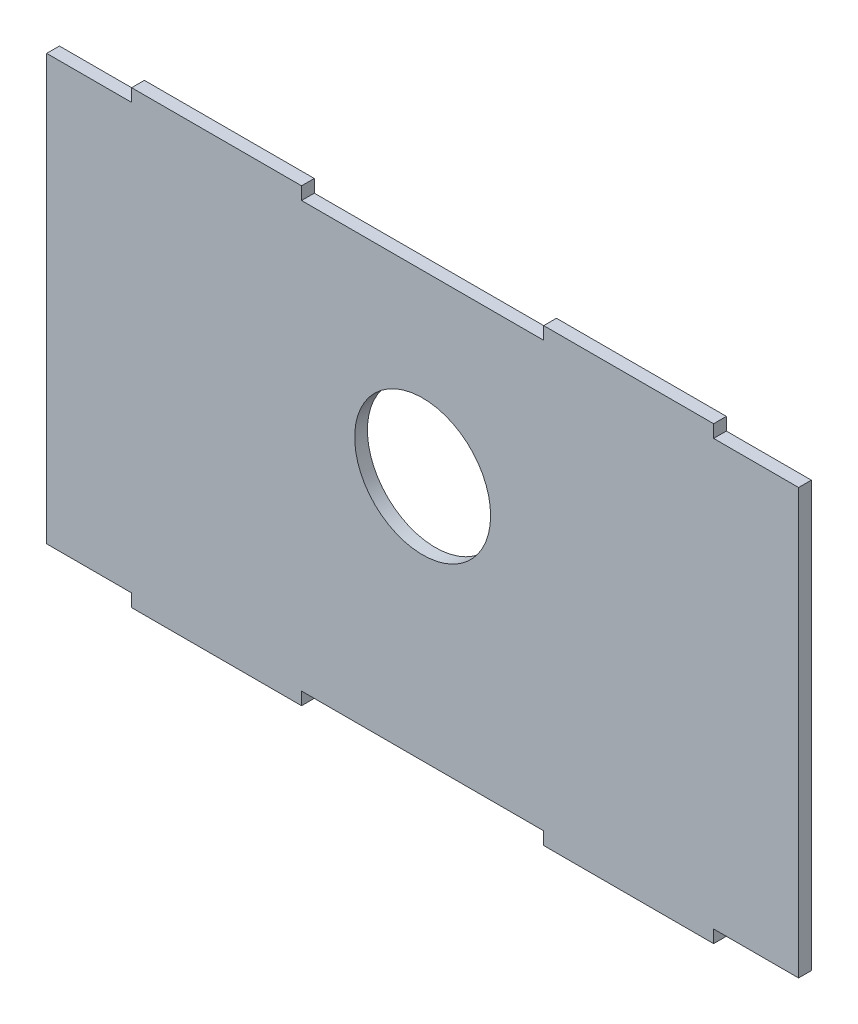
ISO-10303-21;
HEADER;
FILE_DESCRIPTION(('STEP AP214'),'2;1');
FILE_NAME('part.step','',(''),(''),'','','');
FILE_SCHEMA(('AUTOMOTIVE_DESIGN { 1 0 10303 214 1 1 1 1 }'));
ENDSEC;
DATA;
#1=APPLICATION_CONTEXT('core data for automotive mechanical design processes');
#2=APPLICATION_PROTOCOL_DEFINITION('international standard','automotive_design',2000,#1);
#3=PRODUCT_CONTEXT('',#1,'mechanical');
#4=PRODUCT('Part','Part','',(#3));
#5=PRODUCT_RELATED_PRODUCT_CATEGORY('part','',(#4));
#6=PRODUCT_DEFINITION_FORMATION('','',#4);
#7=PRODUCT_DEFINITION_CONTEXT('part definition',#1,'design');
#8=PRODUCT_DEFINITION('design','',#6,#7);
#9=PRODUCT_DEFINITION_SHAPE('','',#8);
#10=(LENGTH_UNIT() NAMED_UNIT(*) SI_UNIT(.MILLI.,.METRE.));
#11=(NAMED_UNIT(*) PLANE_ANGLE_UNIT() SI_UNIT($,.RADIAN.));
#12=(NAMED_UNIT(*) SI_UNIT($,.STERADIAN.) SOLID_ANGLE_UNIT());
#13=UNCERTAINTY_MEASURE_WITH_UNIT(LENGTH_MEASURE(1.E-05),#10,'distance_accuracy_value','');
#14=(GEOMETRIC_REPRESENTATION_CONTEXT(3) GLOBAL_UNCERTAINTY_ASSIGNED_CONTEXT((#13)) GLOBAL_UNIT_ASSIGNED_CONTEXT((#10,
#11,#12)) REPRESENTATION_CONTEXT('',''));
#15=CARTESIAN_POINT('',(0.,0.,0.));
#16=DIRECTION('',(0.,0.,1.));
#17=DIRECTION('',(1.,0.,0.));
#18=AXIS2_PLACEMENT_3D('',#15,#16,#17);
#19=CARTESIAN_POINT('',(0.,0.,1.5));
#20=DIRECTION('',(0.,0.,-1.));
#21=DIRECTION('',(-1.,0.,0.));
#22=AXIS2_PLACEMENT_3D('',#19,#20,#21);
#23=PLANE('',#22);
#24=DIRECTION('',(1.,0.,0.));
#25=VECTOR('',#24,1.);
#26=CARTESIAN_POINT('',(68.5,-50.,1.5));
#27=LINE('',#26,#25);
#28=CARTESIAN_POINT('',(68.5,-50.,1.5));
#29=VERTEX_POINT('',#28);
#30=CARTESIAN_POINT('',(88.5,-50.,1.5));
#31=VERTEX_POINT('',#30);
#32=EDGE_CURVE('E241',#29,#31,#27,.T.);
#33=ORIENTED_EDGE('',*,*,#32,.T.);
#34=DIRECTION('',(0.,1.,0.));
#35=VECTOR('',#34,1.);
#36=CARTESIAN_POINT('',(88.5,50.,1.5));
#37=LINE('',#36,#35);
#38=CARTESIAN_POINT('',(88.5,50.,1.5));
#39=VERTEX_POINT('',#38);
#40=EDGE_CURVE('E129',#31,#39,#37,.T.);
#41=ORIENTED_EDGE('',*,*,#40,.T.);
#42=DIRECTION('',(-1.,0.,0.));
#43=VECTOR('',#42,1.);
#44=CARTESIAN_POINT('',(68.5,50.,1.5));
#45=LINE('',#44,#43);
#46=CARTESIAN_POINT('',(68.5,50.,1.5));
#47=VERTEX_POINT('',#46);
#48=EDGE_CURVE('E292',#39,#47,#45,.T.);
#49=ORIENTED_EDGE('',*,*,#48,.T.);
#50=DIRECTION('',(0.,1.,0.));
#51=VECTOR('',#50,1.);
#52=CARTESIAN_POINT('',(68.5,50.,1.5));
#53=LINE('',#52,#51);
#54=CARTESIAN_POINT('',(68.5,53.,1.5));
#55=VERTEX_POINT('',#54);
#56=EDGE_CURVE('E311',#47,#55,#53,.T.);
#57=ORIENTED_EDGE('',*,*,#56,.T.);
#58=DIRECTION('',(-1.,0.,0.));
#59=VECTOR('',#58,1.);
#60=CARTESIAN_POINT('',(28.5,53.,1.5));
#61=LINE('',#60,#59);
#62=CARTESIAN_POINT('',(28.5,53.,1.5));
#63=VERTEX_POINT('',#62);
#64=EDGE_CURVE('E308',#55,#63,#61,.T.);
#65=ORIENTED_EDGE('',*,*,#64,.T.);
#66=DIRECTION('',(0.,-1.,0.));
#67=VECTOR('',#66,1.);
#68=CARTESIAN_POINT('',(28.5,50.,1.5));
#69=LINE('',#68,#67);
#70=CARTESIAN_POINT('',(28.5,50.,1.5));
#71=VERTEX_POINT('',#70);
#72=EDGE_CURVE('E310',#63,#71,#69,.T.);
#73=ORIENTED_EDGE('',*,*,#72,.T.);
#74=DIRECTION('',(-1.,0.,0.));
#75=VECTOR('',#74,1.);
#76=CARTESIAN_POINT('',(-28.5,50.,1.5));
#77=LINE('',#76,#75);
#78=CARTESIAN_POINT('',(-28.5,50.,1.5));
#79=VERTEX_POINT('',#78);
#80=EDGE_CURVE('E313',#71,#79,#77,.T.);
#81=ORIENTED_EDGE('',*,*,#80,.T.);
#82=DIRECTION('',(0.,1.,0.));
#83=VECTOR('',#82,1.);
#84=CARTESIAN_POINT('',(-28.5,50.,1.5));
#85=LINE('',#84,#83);
#86=CARTESIAN_POINT('',(-28.5,53.,1.5));
#87=VERTEX_POINT('',#86);
#88=EDGE_CURVE('E319',#79,#87,#85,.T.);
#89=ORIENTED_EDGE('',*,*,#88,.T.);
#90=DIRECTION('',(-1.,0.,0.));
#91=VECTOR('',#90,1.);
#92=CARTESIAN_POINT('',(-68.5,53.,1.5));
#93=LINE('',#92,#91);
#94=CARTESIAN_POINT('',(-68.5,53.,1.5));
#95=VERTEX_POINT('',#94);
#96=EDGE_CURVE('E321',#87,#95,#93,.T.);
#97=ORIENTED_EDGE('',*,*,#96,.T.);
#98=DIRECTION('',(0.,-1.,0.));
#99=VECTOR('',#98,1.);
#100=CARTESIAN_POINT('',(-68.5,50.,1.5));
#101=LINE('',#100,#99);
#102=CARTESIAN_POINT('',(-68.5,50.,1.5));
#103=VERTEX_POINT('',#102);
#104=EDGE_CURVE('E323',#95,#103,#101,.T.);
#105=ORIENTED_EDGE('',*,*,#104,.T.);
#106=DIRECTION('',(-1.,0.,0.));
#107=VECTOR('',#106,1.);
#108=CARTESIAN_POINT('',(-88.5,50.,1.5));
#109=LINE('',#108,#107);
#110=CARTESIAN_POINT('',(-88.5,50.,1.5));
#111=VERTEX_POINT('',#110);
#112=EDGE_CURVE('E325',#103,#111,#109,.T.);
#113=ORIENTED_EDGE('',*,*,#112,.T.);
#114=DIRECTION('',(0.,-1.,0.));
#115=VECTOR('',#114,1.);
#116=CARTESIAN_POINT('',(-88.5,50.,1.5));
#117=LINE('',#116,#115);
#118=CARTESIAN_POINT('',(-88.5,-50.,1.5));
#119=VERTEX_POINT('',#118);
#120=EDGE_CURVE('E327',#111,#119,#117,.T.);
#121=ORIENTED_EDGE('',*,*,#120,.T.);
#122=DIRECTION('',(1.,0.,0.));
#123=VECTOR('',#122,1.);
#124=CARTESIAN_POINT('',(-88.5,-50.,1.5));
#125=LINE('',#124,#123);
#126=CARTESIAN_POINT('',(-68.5,-50.,1.5));
#127=VERTEX_POINT('',#126);
#128=EDGE_CURVE('E329',#119,#127,#125,.T.);
#129=ORIENTED_EDGE('',*,*,#128,.T.);
#130=DIRECTION('',(0.,-1.,0.));
#131=VECTOR('',#130,1.);
#132=CARTESIAN_POINT('',(-68.5,-50.,1.5));
#133=LINE('',#132,#131);
#134=CARTESIAN_POINT('',(-68.5,-53.,1.5));
#135=VERTEX_POINT('',#134);
#136=EDGE_CURVE('E331',#127,#135,#133,.T.);
#137=ORIENTED_EDGE('',*,*,#136,.T.);
#138=DIRECTION('',(1.,0.,0.));
#139=VECTOR('',#138,1.);
#140=CARTESIAN_POINT('',(-68.5,-53.,1.5));
#141=LINE('',#140,#139);
#142=CARTESIAN_POINT('',(-28.5,-53.,1.5));
#143=VERTEX_POINT('',#142);
#144=EDGE_CURVE('E333',#135,#143,#141,.T.);
#145=ORIENTED_EDGE('',*,*,#144,.T.);
#146=DIRECTION('',(0.,1.,0.));
#147=VECTOR('',#146,1.);
#148=CARTESIAN_POINT('',(-28.5,-50.,1.5));
#149=LINE('',#148,#147);
#150=CARTESIAN_POINT('',(-28.5,-50.,1.5));
#151=VERTEX_POINT('',#150);
#152=EDGE_CURVE('E335',#143,#151,#149,.T.);
#153=ORIENTED_EDGE('',*,*,#152,.T.);
#154=DIRECTION('',(1.,0.,0.));
#155=VECTOR('',#154,1.);
#156=CARTESIAN_POINT('',(-28.5,-50.,1.5));
#157=LINE('',#156,#155);
#158=CARTESIAN_POINT('',(28.5,-50.,1.5));
#159=VERTEX_POINT('',#158);
#160=EDGE_CURVE('E184',#151,#159,#157,.T.);
#161=ORIENTED_EDGE('',*,*,#160,.T.);
#162=DIRECTION('',(0.,-1.,0.));
#163=VECTOR('',#162,1.);
#164=CARTESIAN_POINT('',(28.5,-50.,1.5));
#165=LINE('',#164,#163);
#166=CARTESIAN_POINT('',(28.5,-53.,1.5));
#167=VERTEX_POINT('',#166);
#168=EDGE_CURVE('E178',#159,#167,#165,.T.);
#169=ORIENTED_EDGE('',*,*,#168,.T.);
#170=DIRECTION('',(1.,0.,0.));
#171=VECTOR('',#170,1.);
#172=CARTESIAN_POINT('',(28.5,-53.,1.5));
#173=LINE('',#172,#171);
#174=CARTESIAN_POINT('',(68.5,-53.,1.5));
#175=VERTEX_POINT('',#174);
#176=EDGE_CURVE('E182',#167,#175,#173,.T.);
#177=ORIENTED_EDGE('',*,*,#176,.T.);
#178=DIRECTION('',(0.,1.,0.));
#179=VECTOR('',#178,1.);
#180=CARTESIAN_POINT('',(68.5,-50.,1.5));
#181=LINE('',#180,#179);
#182=EDGE_CURVE('E50',#175,#29,#181,.T.);
#183=ORIENTED_EDGE('',*,*,#182,.T.);
#184=EDGE_LOOP('',(#33,#41,#49,#57,#65,#73,#81,#89,#97,#105,#113,#121,#129,#137,#145,#153,#161,
#169,#177,#183));
#185=FACE_BOUND('',#184,.T.);
#186=CARTESIAN_POINT('',(0.,8.00000000000001,1.5));
#187=DIRECTION('',(0.,0.,1.));
#188=DIRECTION('',(1.,0.,0.));
#189=AXIS2_PLACEMENT_3D('',#186,#187,#188);
#190=CIRCLE('',#189,16.);
#191=CARTESIAN_POINT('',(16.,8.00000000000001,1.5));
#192=VERTEX_POINT('',#191);
#193=EDGE_CURVE('E206',#192,#192,#190,.T.);
#194=ORIENTED_EDGE('',*,*,#193,.F.);
#195=EDGE_LOOP('',(#194));
#196=FACE_BOUND('',#195,.T.);
#197=ADVANCED_FACE('F33',(#185,#196),#23,.F.);
#198=CARTESIAN_POINT('',(0.,0.,-1.5));
#199=DIRECTION('',(0.,0.,-1.));
#200=DIRECTION('',(-1.,0.,0.));
#201=AXIS2_PLACEMENT_3D('',#198,#199,#200);
#202=PLANE('',#201);
#203=DIRECTION('',(1.,0.,0.));
#204=VECTOR('',#203,1.);
#205=CARTESIAN_POINT('',(68.5,-50.,-1.5));
#206=LINE('',#205,#204);
#207=CARTESIAN_POINT('',(68.5,-50.,-1.5));
#208=VERTEX_POINT('',#207);
#209=CARTESIAN_POINT('',(88.5,-50.,-1.5));
#210=VERTEX_POINT('',#209);
#211=EDGE_CURVE('E202',#208,#210,#206,.T.);
#212=ORIENTED_EDGE('',*,*,#211,.F.);
#213=DIRECTION('',(0.,1.,0.));
#214=VECTOR('',#213,1.);
#215=CARTESIAN_POINT('',(68.5,-50.,-1.5));
#216=LINE('',#215,#214);
#217=CARTESIAN_POINT('',(68.5,-53.,-1.5));
#218=VERTEX_POINT('',#217);
#219=EDGE_CURVE('E121',#218,#208,#216,.T.);
#220=ORIENTED_EDGE('',*,*,#219,.F.);
#221=DIRECTION('',(1.,0.,0.));
#222=VECTOR('',#221,1.);
#223=CARTESIAN_POINT('',(28.5,-53.,-1.5));
#224=LINE('',#223,#222);
#225=CARTESIAN_POINT('',(28.5,-53.,-1.5));
#226=VERTEX_POINT('',#225);
#227=EDGE_CURVE('E115',#226,#218,#224,.T.);
#228=ORIENTED_EDGE('',*,*,#227,.F.);
#229=DIRECTION('',(0.,-1.,0.));
#230=VECTOR('',#229,1.);
#231=CARTESIAN_POINT('',(28.5,-50.,-1.5));
#232=LINE('',#231,#230);
#233=CARTESIAN_POINT('',(28.5,-50.,-1.5));
#234=VERTEX_POINT('',#233);
#235=EDGE_CURVE('E192',#234,#226,#232,.T.);
#236=ORIENTED_EDGE('',*,*,#235,.F.);
#237=DIRECTION('',(1.,0.,0.));
#238=VECTOR('',#237,1.);
#239=CARTESIAN_POINT('',(-28.5,-50.,-1.5));
#240=LINE('',#239,#238);
#241=CARTESIAN_POINT('',(-28.5,-50.,-1.5));
#242=VERTEX_POINT('',#241);
#243=EDGE_CURVE('E236',#242,#234,#240,.T.);
#244=ORIENTED_EDGE('',*,*,#243,.F.);
#245=DIRECTION('',(0.,1.,0.));
#246=VECTOR('',#245,1.);
#247=CARTESIAN_POINT('',(-28.5,-50.,-1.5));
#248=LINE('',#247,#246);
#249=CARTESIAN_POINT('',(-28.5,-53.,-1.5));
#250=VERTEX_POINT('',#249);
#251=EDGE_CURVE('E234',#250,#242,#248,.T.);
#252=ORIENTED_EDGE('',*,*,#251,.F.);
#253=DIRECTION('',(1.,0.,0.));
#254=VECTOR('',#253,1.);
#255=CARTESIAN_POINT('',(-68.5,-53.,-1.5));
#256=LINE('',#255,#254);
#257=CARTESIAN_POINT('',(-68.5,-53.,-1.5));
#258=VERTEX_POINT('',#257);
#259=EDGE_CURVE('E232',#258,#250,#256,.T.);
#260=ORIENTED_EDGE('',*,*,#259,.F.);
#261=DIRECTION('',(0.,-1.,0.));
#262=VECTOR('',#261,1.);
#263=CARTESIAN_POINT('',(-68.5,-50.,-1.5));
#264=LINE('',#263,#262);
#265=CARTESIAN_POINT('',(-68.5,-50.,-1.5));
#266=VERTEX_POINT('',#265);
#267=EDGE_CURVE('E230',#266,#258,#264,.T.);
#268=ORIENTED_EDGE('',*,*,#267,.F.);
#269=DIRECTION('',(1.,0.,0.));
#270=VECTOR('',#269,1.);
#271=CARTESIAN_POINT('',(-88.5,-50.,-1.5));
#272=LINE('',#271,#270);
#273=CARTESIAN_POINT('',(-88.5,-50.,-1.5));
#274=VERTEX_POINT('',#273);
#275=EDGE_CURVE('E228',#274,#266,#272,.T.);
#276=ORIENTED_EDGE('',*,*,#275,.F.);
#277=DIRECTION('',(0.,-1.,0.));
#278=VECTOR('',#277,1.);
#279=CARTESIAN_POINT('',(-88.5,50.,-1.5));
#280=LINE('',#279,#278);
#281=CARTESIAN_POINT('',(-88.5,50.,-1.5));
#282=VERTEX_POINT('',#281);
#283=EDGE_CURVE('E226',#282,#274,#280,.T.);
#284=ORIENTED_EDGE('',*,*,#283,.F.);
#285=DIRECTION('',(-1.,0.,0.));
#286=VECTOR('',#285,1.);
#287=CARTESIAN_POINT('',(-88.5,50.,-1.5));
#288=LINE('',#287,#286);
#289=CARTESIAN_POINT('',(-68.5,50.,-1.5));
#290=VERTEX_POINT('',#289);
#291=EDGE_CURVE('E224',#290,#282,#288,.T.);
#292=ORIENTED_EDGE('',*,*,#291,.F.);
#293=DIRECTION('',(0.,-1.,0.));
#294=VECTOR('',#293,1.);
#295=CARTESIAN_POINT('',(-68.5,50.,-1.5));
#296=LINE('',#295,#294);
#297=CARTESIAN_POINT('',(-68.5,53.,-1.5));
#298=VERTEX_POINT('',#297);
#299=EDGE_CURVE('E222',#298,#290,#296,.T.);
#300=ORIENTED_EDGE('',*,*,#299,.F.);
#301=DIRECTION('',(-1.,0.,0.));
#302=VECTOR('',#301,1.);
#303=CARTESIAN_POINT('',(-68.5,53.,-1.5));
#304=LINE('',#303,#302);
#305=CARTESIAN_POINT('',(-28.5,53.,-1.5));
#306=VERTEX_POINT('',#305);
#307=EDGE_CURVE('E220',#306,#298,#304,.T.);
#308=ORIENTED_EDGE('',*,*,#307,.F.);
#309=DIRECTION('',(0.,1.,0.));
#310=VECTOR('',#309,1.);
#311=CARTESIAN_POINT('',(-28.5,50.,-1.5));
#312=LINE('',#311,#310);
#313=CARTESIAN_POINT('',(-28.5,50.,-1.5));
#314=VERTEX_POINT('',#313);
#315=EDGE_CURVE('E218',#314,#306,#312,.T.);
#316=ORIENTED_EDGE('',*,*,#315,.F.);
#317=DIRECTION('',(-1.,0.,0.));
#318=VECTOR('',#317,1.);
#319=CARTESIAN_POINT('',(-28.5,50.,-1.5));
#320=LINE('',#319,#318);
#321=CARTESIAN_POINT('',(28.5,50.,-1.5));
#322=VERTEX_POINT('',#321);
#323=EDGE_CURVE('E216',#322,#314,#320,.T.);
#324=ORIENTED_EDGE('',*,*,#323,.F.);
#325=DIRECTION('',(0.,-1.,0.));
#326=VECTOR('',#325,1.);
#327=CARTESIAN_POINT('',(28.5,50.,-1.5));
#328=LINE('',#327,#326);
#329=CARTESIAN_POINT('',(28.5,53.,-1.5));
#330=VERTEX_POINT('',#329);
#331=EDGE_CURVE('E214',#330,#322,#328,.T.);
#332=ORIENTED_EDGE('',*,*,#331,.F.);
#333=DIRECTION('',(-1.,0.,0.));
#334=VECTOR('',#333,1.);
#335=CARTESIAN_POINT('',(28.5,53.,-1.5));
#336=LINE('',#335,#334);
#337=CARTESIAN_POINT('',(68.5,53.,-1.5));
#338=VERTEX_POINT('',#337);
#339=EDGE_CURVE('E212',#338,#330,#336,.T.);
#340=ORIENTED_EDGE('',*,*,#339,.F.);
#341=DIRECTION('',(0.,1.,0.));
#342=VECTOR('',#341,1.);
#343=CARTESIAN_POINT('',(68.5,50.,-1.5));
#344=LINE('',#343,#342);
#345=CARTESIAN_POINT('',(68.5,50.,-1.5));
#346=VERTEX_POINT('',#345);
#347=EDGE_CURVE('E210',#346,#338,#344,.T.);
#348=ORIENTED_EDGE('',*,*,#347,.F.);
#349=DIRECTION('',(-1.,0.,0.));
#350=VECTOR('',#349,1.);
#351=CARTESIAN_POINT('',(68.5,50.,-1.5));
#352=LINE('',#351,#350);
#353=CARTESIAN_POINT('',(88.5,50.,-1.5));
#354=VERTEX_POINT('',#353);
#355=EDGE_CURVE('E208',#354,#346,#352,.T.);
#356=ORIENTED_EDGE('',*,*,#355,.F.);
#357=DIRECTION('',(0.,1.,0.));
#358=VECTOR('',#357,1.);
#359=CARTESIAN_POINT('',(88.5,50.,-1.5));
#360=LINE('',#359,#358);
#361=EDGE_CURVE('E205',#210,#354,#360,.T.);
#362=ORIENTED_EDGE('',*,*,#361,.F.);
#363=EDGE_LOOP('',(#212,#220,#228,#236,#244,#252,#260,#268,#276,#284,#292,#300,#308,#316,#324,
#332,#340,#348,#356,#362));
#364=FACE_BOUND('',#363,.T.);
#365=CARTESIAN_POINT('',(0.,8.00000000000001,-1.5));
#366=DIRECTION('',(0.,0.,1.));
#367=DIRECTION('',(1.,0.,0.));
#368=AXIS2_PLACEMENT_3D('',#365,#366,#367);
#369=CIRCLE('',#368,16.);
#370=CARTESIAN_POINT('',(16.,8.00000000000001,-1.5));
#371=VERTEX_POINT('',#370);
#372=EDGE_CURVE('E586',#371,#371,#369,.T.);
#373=ORIENTED_EDGE('',*,*,#372,.T.);
#374=EDGE_LOOP('',(#373));
#375=FACE_BOUND('',#374,.T.);
#376=ADVANCED_FACE('F296',(#364,#375),#202,.T.);
#377=CARTESIAN_POINT('',(68.5,-50.,1.5));
#378=DIRECTION('',(0.,1.,0.));
#379=DIRECTION('',(0.,0.,1.));
#380=AXIS2_PLACEMENT_3D('',#377,#378,#379);
#381=PLANE('',#380);
#382=ORIENTED_EDGE('',*,*,#211,.T.);
#383=DIRECTION('',(0.,0.,-1.));
#384=VECTOR('',#383,1.);
#385=CARTESIAN_POINT('',(88.5,-50.,1.5));
#386=LINE('',#385,#384);
#387=EDGE_CURVE('E11',#31,#210,#386,.T.);
#388=ORIENTED_EDGE('',*,*,#387,.F.);
#389=ORIENTED_EDGE('',*,*,#32,.F.);
#390=DIRECTION('',(0.,0.,-1.));
#391=VECTOR('',#390,1.);
#392=CARTESIAN_POINT('',(68.5,-50.,1.5));
#393=LINE('',#392,#391);
#394=EDGE_CURVE('E198',#29,#208,#393,.T.);
#395=ORIENTED_EDGE('',*,*,#394,.T.);
#396=EDGE_LOOP('',(#382,#388,#389,#395));
#397=FACE_BOUND('',#396,.T.);
#398=ADVANCED_FACE('F35',(#397),#381,.F.);
#399=CARTESIAN_POINT('',(88.5,50.,1.5));
#400=DIRECTION('',(-1.,0.,0.));
#401=DIRECTION('',(0.,0.,1.));
#402=AXIS2_PLACEMENT_3D('',#399,#400,#401);
#403=PLANE('',#402);
#404=ORIENTED_EDGE('',*,*,#361,.T.);
#405=DIRECTION('',(0.,0.,-1.));
#406=VECTOR('',#405,1.);
#407=CARTESIAN_POINT('',(88.5,50.,1.5));
#408=LINE('',#407,#406);
#409=EDGE_CURVE('E42',#39,#354,#408,.T.);
#410=ORIENTED_EDGE('',*,*,#409,.F.);
#411=ORIENTED_EDGE('',*,*,#40,.F.);
#412=ORIENTED_EDGE('',*,*,#387,.T.);
#413=EDGE_LOOP('',(#404,#410,#411,#412));
#414=FACE_BOUND('',#413,.T.);
#415=ADVANCED_FACE('F369',(#414),#403,.F.);
#416=CARTESIAN_POINT('',(68.5,50.,1.5));
#417=DIRECTION('',(0.,-1.,0.));
#418=DIRECTION('',(0.,0.,-1.));
#419=AXIS2_PLACEMENT_3D('',#416,#417,#418);
#420=PLANE('',#419);
#421=ORIENTED_EDGE('',*,*,#355,.T.);
#422=DIRECTION('',(0.,0.,-1.));
#423=VECTOR('',#422,1.);
#424=CARTESIAN_POINT('',(68.5,50.,1.5));
#425=LINE('',#424,#423);
#426=EDGE_CURVE('E284',#47,#346,#425,.T.);
#427=ORIENTED_EDGE('',*,*,#426,.F.);
#428=ORIENTED_EDGE('',*,*,#48,.F.);
#429=ORIENTED_EDGE('',*,*,#409,.T.);
#430=EDGE_LOOP('',(#421,#427,#428,#429));
#431=FACE_BOUND('',#430,.T.);
#432=ADVANCED_FACE('F290',(#431),#420,.F.);
#433=CARTESIAN_POINT('',(68.5,50.,1.5));
#434=DIRECTION('',(-1.,0.,0.));
#435=DIRECTION('',(0.,0.,1.));
#436=AXIS2_PLACEMENT_3D('',#433,#434,#435);
#437=PLANE('',#436);
#438=ORIENTED_EDGE('',*,*,#347,.T.);
#439=DIRECTION('',(0.,0.,-1.));
#440=VECTOR('',#439,1.);
#441=CARTESIAN_POINT('',(68.5,53.,1.5));
#442=LINE('',#441,#440);
#443=EDGE_CURVE('E281',#55,#338,#442,.T.);
#444=ORIENTED_EDGE('',*,*,#443,.F.);
#445=ORIENTED_EDGE('',*,*,#56,.F.);
#446=ORIENTED_EDGE('',*,*,#426,.T.);
#447=EDGE_LOOP('',(#438,#444,#445,#446));
#448=FACE_BOUND('',#447,.T.);
#449=ADVANCED_FACE('F302',(#448),#437,.F.);
#450=CARTESIAN_POINT('',(28.5,53.,1.5));
#451=DIRECTION('',(0.,-1.,0.));
#452=DIRECTION('',(0.,0.,-1.));
#453=AXIS2_PLACEMENT_3D('',#450,#451,#452);
#454=PLANE('',#453);
#455=ORIENTED_EDGE('',*,*,#339,.T.);
#456=DIRECTION('',(0.,0.,-1.));
#457=VECTOR('',#456,1.);
#458=CARTESIAN_POINT('',(28.5,53.,1.5));
#459=LINE('',#458,#457);
#460=EDGE_CURVE('E278',#63,#330,#459,.T.);
#461=ORIENTED_EDGE('',*,*,#460,.F.);
#462=ORIENTED_EDGE('',*,*,#64,.F.);
#463=ORIENTED_EDGE('',*,*,#443,.T.);
#464=EDGE_LOOP('',(#455,#461,#462,#463));
#465=FACE_BOUND('',#464,.T.);
#466=ADVANCED_FACE('F306',(#465),#454,.F.);
#467=CARTESIAN_POINT('',(28.5,50.,1.5));
#468=DIRECTION('',(1.,0.,0.));
#469=DIRECTION('',(0.,0.,-1.));
#470=AXIS2_PLACEMENT_3D('',#467,#468,#469);
#471=PLANE('',#470);
#472=ORIENTED_EDGE('',*,*,#331,.T.);
#473=DIRECTION('',(0.,0.,-1.));
#474=VECTOR('',#473,1.);
#475=CARTESIAN_POINT('',(28.5,50.,1.5));
#476=LINE('',#475,#474);
#477=EDGE_CURVE('E275',#71,#322,#476,.T.);
#478=ORIENTED_EDGE('',*,*,#477,.F.);
#479=ORIENTED_EDGE('',*,*,#72,.F.);
#480=ORIENTED_EDGE('',*,*,#460,.T.);
#481=EDGE_LOOP('',(#472,#478,#479,#480));
#482=FACE_BOUND('',#481,.T.);
#483=ADVANCED_FACE('F382',(#482),#471,.F.);
#484=CARTESIAN_POINT('',(-28.5,50.,1.5));
#485=DIRECTION('',(0.,-1.,0.));
#486=DIRECTION('',(0.,0.,-1.));
#487=AXIS2_PLACEMENT_3D('',#484,#485,#486);
#488=PLANE('',#487);
#489=ORIENTED_EDGE('',*,*,#323,.T.);
#490=DIRECTION('',(0.,0.,-1.));
#491=VECTOR('',#490,1.);
#492=CARTESIAN_POINT('',(-28.5,50.,1.5));
#493=LINE('',#492,#491);
#494=EDGE_CURVE('E272',#79,#314,#493,.T.);
#495=ORIENTED_EDGE('',*,*,#494,.F.);
#496=ORIENTED_EDGE('',*,*,#80,.F.);
#497=ORIENTED_EDGE('',*,*,#477,.T.);
#498=EDGE_LOOP('',(#489,#495,#496,#497));
#499=FACE_BOUND('',#498,.T.);
#500=ADVANCED_FACE('F385',(#499),#488,.F.);
#501=CARTESIAN_POINT('',(-28.5,50.,1.5));
#502=DIRECTION('',(-1.,0.,0.));
#503=DIRECTION('',(0.,0.,1.));
#504=AXIS2_PLACEMENT_3D('',#501,#502,#503);
#505=PLANE('',#504);
#506=ORIENTED_EDGE('',*,*,#315,.T.);
#507=DIRECTION('',(0.,0.,-1.));
#508=VECTOR('',#507,1.);
#509=CARTESIAN_POINT('',(-28.5,53.,1.5));
#510=LINE('',#509,#508);
#511=EDGE_CURVE('E269',#87,#306,#510,.T.);
#512=ORIENTED_EDGE('',*,*,#511,.F.);
#513=ORIENTED_EDGE('',*,*,#88,.F.);
#514=ORIENTED_EDGE('',*,*,#494,.T.);
#515=EDGE_LOOP('',(#506,#512,#513,#514));
#516=FACE_BOUND('',#515,.T.);
#517=ADVANCED_FACE('F389',(#516),#505,.F.);
#518=CARTESIAN_POINT('',(-68.5,53.,1.5));
#519=DIRECTION('',(0.,-1.,0.));
#520=DIRECTION('',(0.,0.,-1.));
#521=AXIS2_PLACEMENT_3D('',#518,#519,#520);
#522=PLANE('',#521);
#523=ORIENTED_EDGE('',*,*,#307,.T.);
#524=DIRECTION('',(0.,0.,-1.));
#525=VECTOR('',#524,1.);
#526=CARTESIAN_POINT('',(-68.5,53.,1.5));
#527=LINE('',#526,#525);
#528=EDGE_CURVE('E266',#95,#298,#527,.T.);
#529=ORIENTED_EDGE('',*,*,#528,.F.);
#530=ORIENTED_EDGE('',*,*,#96,.F.);
#531=ORIENTED_EDGE('',*,*,#511,.T.);
#532=EDGE_LOOP('',(#523,#529,#530,#531));
#533=FACE_BOUND('',#532,.T.);
#534=ADVANCED_FACE('F393',(#533),#522,.F.);
#535=CARTESIAN_POINT('',(-68.5,50.,1.5));
#536=DIRECTION('',(1.,0.,0.));
#537=DIRECTION('',(0.,0.,-1.));
#538=AXIS2_PLACEMENT_3D('',#535,#536,#537);
#539=PLANE('',#538);
#540=ORIENTED_EDGE('',*,*,#299,.T.);
#541=DIRECTION('',(0.,0.,-1.));
#542=VECTOR('',#541,1.);
#543=CARTESIAN_POINT('',(-68.5,50.,1.5));
#544=LINE('',#543,#542);
#545=EDGE_CURVE('E263',#103,#290,#544,.T.);
#546=ORIENTED_EDGE('',*,*,#545,.F.);
#547=ORIENTED_EDGE('',*,*,#104,.F.);
#548=ORIENTED_EDGE('',*,*,#528,.T.);
#549=EDGE_LOOP('',(#540,#546,#547,#548));
#550=FACE_BOUND('',#549,.T.);
#551=ADVANCED_FACE('F397',(#550),#539,.F.);
#552=CARTESIAN_POINT('',(-88.5,50.,1.5));
#553=DIRECTION('',(0.,-1.,0.));
#554=DIRECTION('',(0.,0.,-1.));
#555=AXIS2_PLACEMENT_3D('',#552,#553,#554);
#556=PLANE('',#555);
#557=ORIENTED_EDGE('',*,*,#291,.T.);
#558=DIRECTION('',(0.,0.,-1.));
#559=VECTOR('',#558,1.);
#560=CARTESIAN_POINT('',(-88.5,50.,1.5));
#561=LINE('',#560,#559);
#562=EDGE_CURVE('E260',#111,#282,#561,.T.);
#563=ORIENTED_EDGE('',*,*,#562,.F.);
#564=ORIENTED_EDGE('',*,*,#112,.F.);
#565=ORIENTED_EDGE('',*,*,#545,.T.);
#566=EDGE_LOOP('',(#557,#563,#564,#565));
#567=FACE_BOUND('',#566,.T.);
#568=ADVANCED_FACE('F401',(#567),#556,.F.);
#569=CARTESIAN_POINT('',(-88.5,50.,1.5));
#570=DIRECTION('',(1.,0.,0.));
#571=DIRECTION('',(0.,0.,-1.));
#572=AXIS2_PLACEMENT_3D('',#569,#570,#571);
#573=PLANE('',#572);
#574=ORIENTED_EDGE('',*,*,#283,.T.);
#575=DIRECTION('',(0.,0.,-1.));
#576=VECTOR('',#575,1.);
#577=CARTESIAN_POINT('',(-88.5,-50.,1.5));
#578=LINE('',#577,#576);
#579=EDGE_CURVE('E257',#119,#274,#578,.T.);
#580=ORIENTED_EDGE('',*,*,#579,.F.);
#581=ORIENTED_EDGE('',*,*,#120,.F.);
#582=ORIENTED_EDGE('',*,*,#562,.T.);
#583=EDGE_LOOP('',(#574,#580,#581,#582));
#584=FACE_BOUND('',#583,.T.);
#585=ADVANCED_FACE('F405',(#584),#573,.F.);
#586=CARTESIAN_POINT('',(-88.5,-50.,1.5));
#587=DIRECTION('',(0.,1.,0.));
#588=DIRECTION('',(0.,0.,1.));
#589=AXIS2_PLACEMENT_3D('',#586,#587,#588);
#590=PLANE('',#589);
#591=ORIENTED_EDGE('',*,*,#275,.T.);
#592=DIRECTION('',(0.,0.,-1.));
#593=VECTOR('',#592,1.);
#594=CARTESIAN_POINT('',(-68.5,-50.,1.5));
#595=LINE('',#594,#593);
#596=EDGE_CURVE('E254',#127,#266,#595,.T.);
#597=ORIENTED_EDGE('',*,*,#596,.F.);
#598=ORIENTED_EDGE('',*,*,#128,.F.);
#599=ORIENTED_EDGE('',*,*,#579,.T.);
#600=EDGE_LOOP('',(#591,#597,#598,#599));
#601=FACE_BOUND('',#600,.T.);
#602=ADVANCED_FACE('F409',(#601),#590,.F.);
#603=CARTESIAN_POINT('',(-68.5,-50.,1.5));
#604=DIRECTION('',(1.,0.,0.));
#605=DIRECTION('',(0.,0.,-1.));
#606=AXIS2_PLACEMENT_3D('',#603,#604,#605);
#607=PLANE('',#606);
#608=ORIENTED_EDGE('',*,*,#267,.T.);
#609=DIRECTION('',(0.,0.,-1.));
#610=VECTOR('',#609,1.);
#611=CARTESIAN_POINT('',(-68.5,-53.,1.5));
#612=LINE('',#611,#610);
#613=EDGE_CURVE('E251',#135,#258,#612,.T.);
#614=ORIENTED_EDGE('',*,*,#613,.F.);
#615=ORIENTED_EDGE('',*,*,#136,.F.);
#616=ORIENTED_EDGE('',*,*,#596,.T.);
#617=EDGE_LOOP('',(#608,#614,#615,#616));
#618=FACE_BOUND('',#617,.T.);
#619=ADVANCED_FACE('F413',(#618),#607,.F.);
#620=CARTESIAN_POINT('',(-68.5,-53.,1.5));
#621=DIRECTION('',(0.,1.,0.));
#622=DIRECTION('',(0.,0.,1.));
#623=AXIS2_PLACEMENT_3D('',#620,#621,#622);
#624=PLANE('',#623);
#625=ORIENTED_EDGE('',*,*,#259,.T.);
#626=DIRECTION('',(0.,0.,-1.));
#627=VECTOR('',#626,1.);
#628=CARTESIAN_POINT('',(-28.5,-53.,1.5));
#629=LINE('',#628,#627);
#630=EDGE_CURVE('E248',#143,#250,#629,.T.);
#631=ORIENTED_EDGE('',*,*,#630,.F.);
#632=ORIENTED_EDGE('',*,*,#144,.F.);
#633=ORIENTED_EDGE('',*,*,#613,.T.);
#634=EDGE_LOOP('',(#625,#631,#632,#633));
#635=FACE_BOUND('',#634,.T.);
#636=ADVANCED_FACE('F417',(#635),#624,.F.);
#637=CARTESIAN_POINT('',(-28.5,-50.,1.5));
#638=DIRECTION('',(-1.,0.,0.));
#639=DIRECTION('',(0.,0.,1.));
#640=AXIS2_PLACEMENT_3D('',#637,#638,#639);
#641=PLANE('',#640);
#642=ORIENTED_EDGE('',*,*,#251,.T.);
#643=DIRECTION('',(0.,0.,-1.));
#644=VECTOR('',#643,1.);
#645=CARTESIAN_POINT('',(-28.5,-50.,1.5));
#646=LINE('',#645,#644);
#647=EDGE_CURVE('E245',#151,#242,#646,.T.);
#648=ORIENTED_EDGE('',*,*,#647,.F.);
#649=ORIENTED_EDGE('',*,*,#152,.F.);
#650=ORIENTED_EDGE('',*,*,#630,.T.);
#651=EDGE_LOOP('',(#642,#648,#649,#650));
#652=FACE_BOUND('',#651,.T.);
#653=ADVANCED_FACE('F341',(#652),#641,.F.);
#654=CARTESIAN_POINT('',(-28.5,-50.,1.5));
#655=DIRECTION('',(0.,1.,0.));
#656=DIRECTION('',(0.,0.,1.));
#657=AXIS2_PLACEMENT_3D('',#654,#655,#656);
#658=PLANE('',#657);
#659=ORIENTED_EDGE('',*,*,#243,.T.);
#660=DIRECTION('',(0.,0.,-1.));
#661=VECTOR('',#660,1.);
#662=CARTESIAN_POINT('',(28.5,-50.,1.5));
#663=LINE('',#662,#661);
#664=EDGE_CURVE('E193',#159,#234,#663,.T.);
#665=ORIENTED_EDGE('',*,*,#664,.F.);
#666=ORIENTED_EDGE('',*,*,#160,.F.);
#667=ORIENTED_EDGE('',*,*,#647,.T.);
#668=EDGE_LOOP('',(#659,#665,#666,#667));
#669=FACE_BOUND('',#668,.T.);
#670=ADVANCED_FACE('F345',(#669),#658,.F.);
#671=CARTESIAN_POINT('',(28.5,-50.,1.5));
#672=DIRECTION('',(1.,0.,0.));
#673=DIRECTION('',(0.,0.,-1.));
#674=AXIS2_PLACEMENT_3D('',#671,#672,#673);
#675=PLANE('',#674);
#676=ORIENTED_EDGE('',*,*,#235,.T.);
#677=DIRECTION('',(0.,0.,-1.));
#678=VECTOR('',#677,1.);
#679=CARTESIAN_POINT('',(28.5,-53.,1.5));
#680=LINE('',#679,#678);
#681=EDGE_CURVE('E189',#167,#226,#680,.T.);
#682=ORIENTED_EDGE('',*,*,#681,.F.);
#683=ORIENTED_EDGE('',*,*,#168,.F.);
#684=ORIENTED_EDGE('',*,*,#664,.T.);
#685=EDGE_LOOP('',(#676,#682,#683,#684));
#686=FACE_BOUND('',#685,.T.);
#687=ADVANCED_FACE('F190',(#686),#675,.F.);
#688=CARTESIAN_POINT('',(28.5,-53.,1.5));
#689=DIRECTION('',(0.,1.,0.));
#690=DIRECTION('',(0.,0.,1.));
#691=AXIS2_PLACEMENT_3D('',#688,#689,#690);
#692=PLANE('',#691);
#693=ORIENTED_EDGE('',*,*,#227,.T.);
#694=DIRECTION('',(0.,0.,-1.));
#695=VECTOR('',#694,1.);
#696=CARTESIAN_POINT('',(68.5,-53.,1.5));
#697=LINE('',#696,#695);
#698=EDGE_CURVE('E194',#175,#218,#697,.T.);
#699=ORIENTED_EDGE('',*,*,#698,.F.);
#700=ORIENTED_EDGE('',*,*,#176,.F.);
#701=ORIENTED_EDGE('',*,*,#681,.T.);
#702=EDGE_LOOP('',(#693,#699,#700,#701));
#703=FACE_BOUND('',#702,.T.);
#704=ADVANCED_FACE('F196',(#703),#692,.F.);
#705=CARTESIAN_POINT('',(68.5,-50.,1.5));
#706=DIRECTION('',(-1.,0.,0.));
#707=DIRECTION('',(0.,0.,1.));
#708=AXIS2_PLACEMENT_3D('',#705,#706,#707);
#709=PLANE('',#708);
#710=ORIENTED_EDGE('',*,*,#219,.T.);
#711=ORIENTED_EDGE('',*,*,#394,.F.);
#712=ORIENTED_EDGE('',*,*,#182,.F.);
#713=ORIENTED_EDGE('',*,*,#698,.T.);
#714=EDGE_LOOP('',(#710,#711,#712,#713));
#715=FACE_BOUND('',#714,.T.);
#716=ADVANCED_FACE('F349',(#715),#709,.F.);
#717=CARTESIAN_POINT('',(0.,8.00000000000001,1.5));
#718=DIRECTION('',(0.,0.,-1.));
#719=DIRECTION('',(-1.,0.,0.));
#720=AXIS2_PLACEMENT_3D('',#717,#718,#719);
#721=CYLINDRICAL_SURFACE('',#720,16.);
#722=ORIENTED_EDGE('',*,*,#193,.T.);
#723=EDGE_LOOP('',(#722));
#724=FACE_BOUND('',#723,.T.);
#725=ORIENTED_EDGE('',*,*,#372,.F.);
#726=EDGE_LOOP('',(#725));
#727=FACE_BOUND('',#726,.T.);
#728=ADVANCED_FACE('F351',(#724,#727),#721,.F.);
#729=CLOSED_SHELL('',(#197,#376,#398,#415,#432,#449,#466,#483,#500,#517,#534,#551,#568,#585,
#602,#619,#636,#653,#670,#687,#704,#716,#728));
#730=MANIFOLD_SOLID_BREP('B2',#729);
#731=ADVANCED_BREP_SHAPE_REPRESENTATION('',(#18,#730),#14);
#732=SHAPE_DEFINITION_REPRESENTATION(#9,#731);
ENDSEC;
END-ISO-10303-21;
